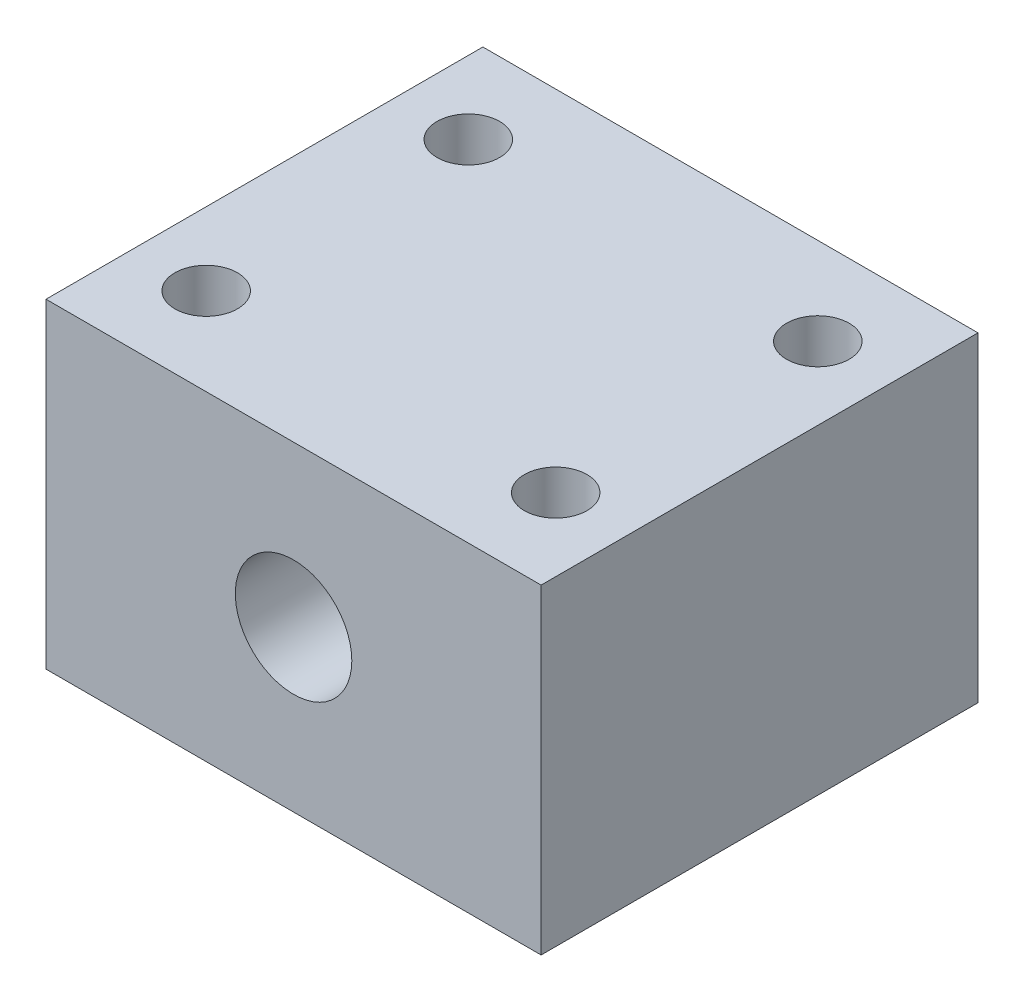
ISO-10303-21;
HEADER;
FILE_DESCRIPTION(('STEP AP214'),'2;1');
FILE_NAME('part.step','',(''),(''),'','','');
FILE_SCHEMA(('AUTOMOTIVE_DESIGN { 1 0 10303 214 1 1 1 1 }'));
ENDSEC;
DATA;
#1=APPLICATION_CONTEXT('core data for automotive mechanical design processes');
#2=APPLICATION_PROTOCOL_DEFINITION('international standard','automotive_design',2000,#1);
#3=PRODUCT_CONTEXT('',#1,'mechanical');
#4=PRODUCT('Part','Part','',(#3));
#5=PRODUCT_RELATED_PRODUCT_CATEGORY('part','',(#4));
#6=PRODUCT_DEFINITION_FORMATION('','',#4);
#7=PRODUCT_DEFINITION_CONTEXT('part definition',#1,'design');
#8=PRODUCT_DEFINITION('design','',#6,#7);
#9=PRODUCT_DEFINITION_SHAPE('','',#8);
#10=(LENGTH_UNIT() NAMED_UNIT(*) SI_UNIT(.MILLI.,.METRE.));
#11=(NAMED_UNIT(*) PLANE_ANGLE_UNIT() SI_UNIT($,.RADIAN.));
#12=(NAMED_UNIT(*) SI_UNIT($,.STERADIAN.) SOLID_ANGLE_UNIT());
#13=UNCERTAINTY_MEASURE_WITH_UNIT(LENGTH_MEASURE(1.E-05),#10,'distance_accuracy_value','');
#14=(GEOMETRIC_REPRESENTATION_CONTEXT(3) GLOBAL_UNCERTAINTY_ASSIGNED_CONTEXT((#13)) GLOBAL_UNIT_ASSIGNED_CONTEXT((#10,
#11,#12)) REPRESENTATION_CONTEXT('',''));
#15=CARTESIAN_POINT('',(0.,0.,0.));
#16=DIRECTION('',(0.,0.,1.));
#17=DIRECTION('',(1.,0.,0.));
#18=AXIS2_PLACEMENT_3D('',#15,#16,#17);
#19=CARTESIAN_POINT('',(17.,22.,-15.));
#20=DIRECTION('',(-1.,0.,0.));
#21=DIRECTION('',(0.,0.,1.));
#22=AXIS2_PLACEMENT_3D('',#19,#20,#21);
#23=PLANE('',#22);
#24=DIRECTION('',(0.,0.,-1.));
#25=VECTOR('',#24,1.);
#26=CARTESIAN_POINT('',(17.,0.,-15.));
#27=LINE('',#26,#25);
#28=CARTESIAN_POINT('',(17.,0.,15.));
#29=VERTEX_POINT('',#28);
#30=CARTESIAN_POINT('',(17.,0.,-15.));
#31=VERTEX_POINT('',#30);
#32=EDGE_CURVE('E96',#29,#31,#27,.T.);
#33=ORIENTED_EDGE('',*,*,#32,.T.);
#34=DIRECTION('',(0.,-1.,0.));
#35=VECTOR('',#34,1.);
#36=CARTESIAN_POINT('',(17.,22.,-15.));
#37=LINE('',#36,#35);
#38=CARTESIAN_POINT('',(17.,22.,-15.));
#39=VERTEX_POINT('',#38);
#40=EDGE_CURVE('E11',#39,#31,#37,.T.);
#41=ORIENTED_EDGE('',*,*,#40,.F.);
#42=DIRECTION('',(0.,0.,-1.));
#43=VECTOR('',#42,1.);
#44=CARTESIAN_POINT('',(17.,22.,-15.));
#45=LINE('',#44,#43);
#46=CARTESIAN_POINT('',(17.,22.,15.));
#47=VERTEX_POINT('',#46);
#48=EDGE_CURVE('E84',#47,#39,#45,.T.);
#49=ORIENTED_EDGE('',*,*,#48,.F.);
#50=DIRECTION('',(0.,-1.,0.));
#51=VECTOR('',#50,1.);
#52=CARTESIAN_POINT('',(17.,22.,15.));
#53=LINE('',#52,#51);
#54=EDGE_CURVE('E92',#47,#29,#53,.T.);
#55=ORIENTED_EDGE('',*,*,#54,.T.);
#56=EDGE_LOOP('',(#33,#41,#49,#55));
#57=FACE_BOUND('',#56,.T.);
#58=ADVANCED_FACE('F33',(#57),#23,.F.);
#59=CARTESIAN_POINT('',(-17.,22.,-15.));
#60=DIRECTION('',(0.,0.,1.));
#61=DIRECTION('',(1.,0.,0.));
#62=AXIS2_PLACEMENT_3D('',#59,#60,#61);
#63=PLANE('',#62);
#64=CARTESIAN_POINT('',(0.,11.,-15.));
#65=DIRECTION('',(0.,0.,1.));
#66=DIRECTION('',(1.,0.,0.));
#67=AXIS2_PLACEMENT_3D('',#64,#65,#66);
#68=CIRCLE('',#67,4.);
#69=CARTESIAN_POINT('',(4.,11.,-15.));
#70=VERTEX_POINT('',#69);
#71=EDGE_CURVE('E120',#70,#70,#68,.T.);
#72=ORIENTED_EDGE('',*,*,#71,.T.);
#73=EDGE_LOOP('',(#72));
#74=FACE_BOUND('',#73,.T.);
#75=DIRECTION('',(-1.,0.,0.));
#76=VECTOR('',#75,1.);
#77=CARTESIAN_POINT('',(-17.,0.,-15.));
#78=LINE('',#77,#76);
#79=CARTESIAN_POINT('',(-17.,0.,-15.));
#80=VERTEX_POINT('',#79);
#81=EDGE_CURVE('E88',#31,#80,#78,.T.);
#82=ORIENTED_EDGE('',*,*,#81,.T.);
#83=DIRECTION('',(0.,-1.,0.));
#84=VECTOR('',#83,1.);
#85=CARTESIAN_POINT('',(-17.,22.,-15.));
#86=LINE('',#85,#84);
#87=CARTESIAN_POINT('',(-17.,22.,-15.));
#88=VERTEX_POINT('',#87);
#89=EDGE_CURVE('E41',#88,#80,#86,.T.);
#90=ORIENTED_EDGE('',*,*,#89,.F.);
#91=DIRECTION('',(-1.,0.,0.));
#92=VECTOR('',#91,1.);
#93=CARTESIAN_POINT('',(-17.,22.,-15.));
#94=LINE('',#93,#92);
#95=EDGE_CURVE('E79',#39,#88,#94,.T.);
#96=ORIENTED_EDGE('',*,*,#95,.F.);
#97=ORIENTED_EDGE('',*,*,#40,.T.);
#98=EDGE_LOOP('',(#82,#90,#96,#97));
#99=FACE_BOUND('',#98,.T.);
#100=ADVANCED_FACE('F87',(#74,#99),#63,.F.);
#101=CARTESIAN_POINT('',(-17.,22.,-15.));
#102=DIRECTION('',(1.,0.,0.));
#103=DIRECTION('',(0.,0.,-1.));
#104=AXIS2_PLACEMENT_3D('',#101,#102,#103);
#105=PLANE('',#104);
#106=DIRECTION('',(0.,0.,1.));
#107=VECTOR('',#106,1.);
#108=CARTESIAN_POINT('',(-17.,0.,-15.));
#109=LINE('',#108,#107);
#110=CARTESIAN_POINT('',(-17.,0.,15.));
#111=VERTEX_POINT('',#110);
#112=EDGE_CURVE('E66',#80,#111,#109,.T.);
#113=ORIENTED_EDGE('',*,*,#112,.T.);
#114=DIRECTION('',(0.,-1.,0.));
#115=VECTOR('',#114,1.);
#116=CARTESIAN_POINT('',(-17.,22.,15.));
#117=LINE('',#116,#115);
#118=CARTESIAN_POINT('',(-17.,22.,15.));
#119=VERTEX_POINT('',#118);
#120=EDGE_CURVE('E89',#119,#111,#117,.T.);
#121=ORIENTED_EDGE('',*,*,#120,.F.);
#122=DIRECTION('',(0.,0.,1.));
#123=VECTOR('',#122,1.);
#124=CARTESIAN_POINT('',(-17.,22.,-15.));
#125=LINE('',#124,#123);
#126=EDGE_CURVE('E82',#88,#119,#125,.T.);
#127=ORIENTED_EDGE('',*,*,#126,.F.);
#128=ORIENTED_EDGE('',*,*,#89,.T.);
#129=EDGE_LOOP('',(#113,#121,#127,#128));
#130=FACE_BOUND('',#129,.T.);
#131=ADVANCED_FACE('F90',(#130),#105,.F.);
#132=CARTESIAN_POINT('',(-17.,22.,15.));
#133=DIRECTION('',(0.,0.,-1.));
#134=DIRECTION('',(-1.,0.,0.));
#135=AXIS2_PLACEMENT_3D('',#132,#133,#134);
#136=PLANE('',#135);
#137=CARTESIAN_POINT('',(0.,11.,15.));
#138=DIRECTION('',(0.,0.,1.));
#139=DIRECTION('',(1.,0.,0.));
#140=AXIS2_PLACEMENT_3D('',#137,#138,#139);
#141=CIRCLE('',#140,4.);
#142=CARTESIAN_POINT('',(4.,11.,15.));
#143=VERTEX_POINT('',#142);
#144=EDGE_CURVE('E134',#143,#143,#141,.T.);
#145=ORIENTED_EDGE('',*,*,#144,.F.);
#146=EDGE_LOOP('',(#145));
#147=FACE_BOUND('',#146,.T.);
#148=DIRECTION('',(1.,0.,0.));
#149=VECTOR('',#148,1.);
#150=CARTESIAN_POINT('',(-17.,0.,15.));
#151=LINE('',#150,#149);
#152=EDGE_CURVE('E72',#111,#29,#151,.T.);
#153=ORIENTED_EDGE('',*,*,#152,.T.);
#154=ORIENTED_EDGE('',*,*,#54,.F.);
#155=DIRECTION('',(1.,0.,0.));
#156=VECTOR('',#155,1.);
#157=CARTESIAN_POINT('',(-17.,22.,15.));
#158=LINE('',#157,#156);
#159=EDGE_CURVE('E49',#119,#47,#158,.T.);
#160=ORIENTED_EDGE('',*,*,#159,.F.);
#161=ORIENTED_EDGE('',*,*,#120,.T.);
#162=EDGE_LOOP('',(#153,#154,#160,#161));
#163=FACE_BOUND('',#162,.T.);
#164=ADVANCED_FACE('F104',(#147,#163),#136,.F.);
#165=CARTESIAN_POINT('',(0.,22.,0.));
#166=DIRECTION('',(0.,1.,0.));
#167=DIRECTION('',(0.,0.,1.));
#168=AXIS2_PLACEMENT_3D('',#165,#166,#167);
#169=PLANE('',#168);
#170=CARTESIAN_POINT('',(-12.,22.,9.));
#171=DIRECTION('',(0.,1.,0.));
#172=DIRECTION('',(0.,0.,1.));
#173=AXIS2_PLACEMENT_3D('',#170,#171,#172);
#174=CIRCLE('',#173,2.15);
#175=CARTESIAN_POINT('',(-12.,22.,11.15));
#176=VERTEX_POINT('',#175);
#177=EDGE_CURVE('E116',#176,#176,#174,.T.);
#178=ORIENTED_EDGE('',*,*,#177,.F.);
#179=EDGE_LOOP('',(#178));
#180=FACE_BOUND('',#179,.T.);
#181=CARTESIAN_POINT('',(12.,22.,9.));
#182=DIRECTION('',(0.,1.,0.));
#183=DIRECTION('',(0.,0.,1.));
#184=AXIS2_PLACEMENT_3D('',#181,#182,#183);
#185=CIRCLE('',#184,2.15);
#186=CARTESIAN_POINT('',(12.,22.,11.15));
#187=VERTEX_POINT('',#186);
#188=EDGE_CURVE('E123',#187,#187,#185,.T.);
#189=ORIENTED_EDGE('',*,*,#188,.F.);
#190=EDGE_LOOP('',(#189));
#191=FACE_BOUND('',#190,.T.);
#192=CARTESIAN_POINT('',(12.,22.,-9.));
#193=DIRECTION('',(0.,1.,0.));
#194=DIRECTION('',(0.,0.,1.));
#195=AXIS2_PLACEMENT_3D('',#192,#193,#194);
#196=CIRCLE('',#195,2.15);
#197=CARTESIAN_POINT('',(12.,22.,-6.85));
#198=VERTEX_POINT('',#197);
#199=EDGE_CURVE('E129',#198,#198,#196,.T.);
#200=ORIENTED_EDGE('',*,*,#199,.F.);
#201=EDGE_LOOP('',(#200));
#202=FACE_BOUND('',#201,.T.);
#203=CARTESIAN_POINT('',(-12.,22.,-9.));
#204=DIRECTION('',(0.,1.,0.));
#205=DIRECTION('',(0.,0.,1.));
#206=AXIS2_PLACEMENT_3D('',#203,#204,#205);
#207=CIRCLE('',#206,2.15);
#208=CARTESIAN_POINT('',(-12.,22.,-6.85));
#209=VERTEX_POINT('',#208);
#210=EDGE_CURVE('E110',#209,#209,#207,.T.);
#211=ORIENTED_EDGE('',*,*,#210,.F.);
#212=EDGE_LOOP('',(#211));
#213=FACE_BOUND('',#212,.T.);
#214=ORIENTED_EDGE('',*,*,#48,.T.);
#215=ORIENTED_EDGE('',*,*,#95,.T.);
#216=ORIENTED_EDGE('',*,*,#126,.T.);
#217=ORIENTED_EDGE('',*,*,#159,.T.);
#218=EDGE_LOOP('',(#214,#215,#216,#217));
#219=FACE_BOUND('',#218,.T.);
#220=ADVANCED_FACE('F80',(#180,#191,#202,#213,#219),#169,.T.);
#221=CARTESIAN_POINT('',(0.,0.,0.));
#222=DIRECTION('',(0.,1.,0.));
#223=DIRECTION('',(0.,0.,1.));
#224=AXIS2_PLACEMENT_3D('',#221,#222,#223);
#225=PLANE('',#224);
#226=CARTESIAN_POINT('',(-12.,0.,9.));
#227=DIRECTION('',(0.,1.,0.));
#228=DIRECTION('',(0.,0.,1.));
#229=AXIS2_PLACEMENT_3D('',#226,#227,#228);
#230=CIRCLE('',#229,2.15);
#231=CARTESIAN_POINT('',(-12.,0.,11.15));
#232=VERTEX_POINT('',#231);
#233=EDGE_CURVE('E119',#232,#232,#230,.T.);
#234=ORIENTED_EDGE('',*,*,#233,.T.);
#235=EDGE_LOOP('',(#234));
#236=FACE_BOUND('',#235,.T.);
#237=CARTESIAN_POINT('',(12.,0.,9.));
#238=DIRECTION('',(0.,1.,0.));
#239=DIRECTION('',(0.,0.,1.));
#240=AXIS2_PLACEMENT_3D('',#237,#238,#239);
#241=CIRCLE('',#240,2.15);
#242=CARTESIAN_POINT('',(12.,0.,11.15));
#243=VERTEX_POINT('',#242);
#244=EDGE_CURVE('E126',#243,#243,#241,.T.);
#245=ORIENTED_EDGE('',*,*,#244,.T.);
#246=EDGE_LOOP('',(#245));
#247=FACE_BOUND('',#246,.T.);
#248=CARTESIAN_POINT('',(12.,0.,-9.));
#249=DIRECTION('',(0.,1.,0.));
#250=DIRECTION('',(0.,0.,1.));
#251=AXIS2_PLACEMENT_3D('',#248,#249,#250);
#252=CIRCLE('',#251,2.15);
#253=CARTESIAN_POINT('',(12.,0.,-6.85));
#254=VERTEX_POINT('',#253);
#255=EDGE_CURVE('E113',#254,#254,#252,.T.);
#256=ORIENTED_EDGE('',*,*,#255,.T.);
#257=EDGE_LOOP('',(#256));
#258=FACE_BOUND('',#257,.T.);
#259=CARTESIAN_POINT('',(-12.,0.,-9.));
#260=DIRECTION('',(0.,1.,0.));
#261=DIRECTION('',(0.,0.,1.));
#262=AXIS2_PLACEMENT_3D('',#259,#260,#261);
#263=CIRCLE('',#262,2.15);
#264=CARTESIAN_POINT('',(-12.,0.,-6.85));
#265=VERTEX_POINT('',#264);
#266=EDGE_CURVE('E99',#265,#265,#263,.T.);
#267=ORIENTED_EDGE('',*,*,#266,.T.);
#268=EDGE_LOOP('',(#267));
#269=FACE_BOUND('',#268,.T.);
#270=ORIENTED_EDGE('',*,*,#32,.F.);
#271=ORIENTED_EDGE('',*,*,#152,.F.);
#272=ORIENTED_EDGE('',*,*,#112,.F.);
#273=ORIENTED_EDGE('',*,*,#81,.F.);
#274=EDGE_LOOP('',(#270,#271,#272,#273));
#275=FACE_BOUND('',#274,.T.);
#276=ADVANCED_FACE('F107',(#236,#247,#258,#269,#275),#225,.F.);
#277=CARTESIAN_POINT('',(-12.,0.,-9.));
#278=DIRECTION('',(0.,1.,0.));
#279=DIRECTION('',(0.,0.,1.));
#280=AXIS2_PLACEMENT_3D('',#277,#278,#279);
#281=CYLINDRICAL_SURFACE('',#280,2.15);
#282=ORIENTED_EDGE('',*,*,#266,.F.);
#283=EDGE_LOOP('',(#282));
#284=FACE_BOUND('',#283,.T.);
#285=ORIENTED_EDGE('',*,*,#210,.T.);
#286=EDGE_LOOP('',(#285));
#287=FACE_BOUND('',#286,.T.);
#288=ADVANCED_FACE('F187',(#284,#287),#281,.F.);
#289=CARTESIAN_POINT('',(12.,0.,-9.));
#290=DIRECTION('',(0.,1.,0.));
#291=DIRECTION('',(0.,0.,1.));
#292=AXIS2_PLACEMENT_3D('',#289,#290,#291);
#293=CYLINDRICAL_SURFACE('',#292,2.15);
#294=ORIENTED_EDGE('',*,*,#255,.F.);
#295=EDGE_LOOP('',(#294));
#296=FACE_BOUND('',#295,.T.);
#297=ORIENTED_EDGE('',*,*,#199,.T.);
#298=EDGE_LOOP('',(#297));
#299=FACE_BOUND('',#298,.T.);
#300=ADVANCED_FACE('F196',(#296,#299),#293,.F.);
#301=CARTESIAN_POINT('',(12.,0.,9.));
#302=DIRECTION('',(0.,1.,0.));
#303=DIRECTION('',(0.,0.,1.));
#304=AXIS2_PLACEMENT_3D('',#301,#302,#303);
#305=CYLINDRICAL_SURFACE('',#304,2.15);
#306=ORIENTED_EDGE('',*,*,#244,.F.);
#307=EDGE_LOOP('',(#306));
#308=FACE_BOUND('',#307,.T.);
#309=ORIENTED_EDGE('',*,*,#188,.T.);
#310=EDGE_LOOP('',(#309));
#311=FACE_BOUND('',#310,.T.);
#312=ADVANCED_FACE('F206',(#308,#311),#305,.F.);
#313=CARTESIAN_POINT('',(-12.,0.,9.));
#314=DIRECTION('',(0.,1.,0.));
#315=DIRECTION('',(0.,0.,1.));
#316=AXIS2_PLACEMENT_3D('',#313,#314,#315);
#317=CYLINDRICAL_SURFACE('',#316,2.15);
#318=ORIENTED_EDGE('',*,*,#233,.F.);
#319=EDGE_LOOP('',(#318));
#320=FACE_BOUND('',#319,.T.);
#321=ORIENTED_EDGE('',*,*,#177,.T.);
#322=EDGE_LOOP('',(#321));
#323=FACE_BOUND('',#322,.T.);
#324=ADVANCED_FACE('F144',(#320,#323),#317,.F.);
#325=CARTESIAN_POINT('',(0.,11.,-15.));
#326=DIRECTION('',(0.,0.,1.));
#327=DIRECTION('',(1.,0.,0.));
#328=AXIS2_PLACEMENT_3D('',#325,#326,#327);
#329=CYLINDRICAL_SURFACE('',#328,4.);
#330=ORIENTED_EDGE('',*,*,#71,.F.);
#331=EDGE_LOOP('',(#330));
#332=FACE_BOUND('',#331,.T.);
#333=ORIENTED_EDGE('',*,*,#144,.T.);
#334=EDGE_LOOP('',(#333));
#335=FACE_BOUND('',#334,.T.);
#336=ADVANCED_FACE('F141',(#332,#335),#329,.F.);
#337=CLOSED_SHELL('',(#58,#100,#131,#164,#220,#276,#288,#300,#312,#324,#336));
#338=MANIFOLD_SOLID_BREP('B2',#337);
#339=ADVANCED_BREP_SHAPE_REPRESENTATION('',(#18,#338),#14);
#340=SHAPE_DEFINITION_REPRESENTATION(#9,#339);
ENDSEC;
END-ISO-10303-21;
